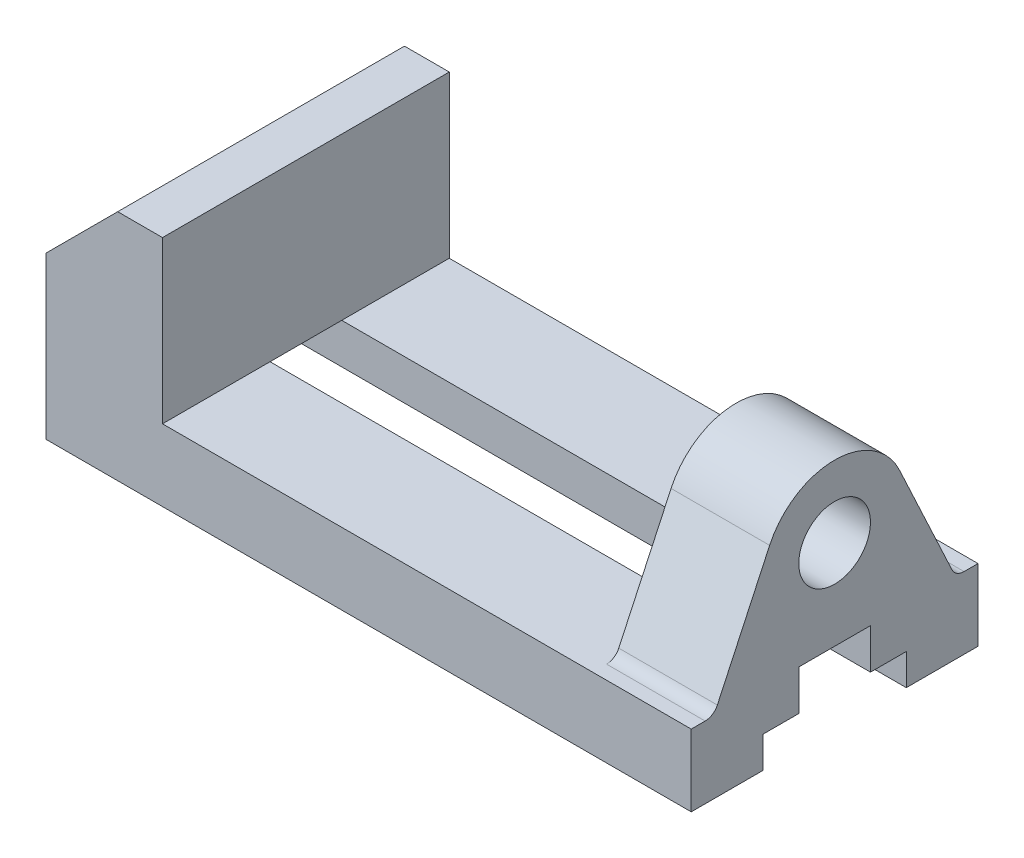
ISO-10303-21;
HEADER;
FILE_DESCRIPTION(('STEP AP214'),'2;1');
FILE_NAME('part.step','',(''),(''),'','','');
FILE_SCHEMA(('AUTOMOTIVE_DESIGN { 1 0 10303 214 1 1 1 1 }'));
ENDSEC;
DATA;
#1=APPLICATION_CONTEXT('core data for automotive mechanical design processes');
#2=APPLICATION_PROTOCOL_DEFINITION('international standard','automotive_design',2000,#1);
#3=PRODUCT_CONTEXT('',#1,'mechanical');
#4=PRODUCT('Part','Part','',(#3));
#5=PRODUCT_RELATED_PRODUCT_CATEGORY('part','',(#4));
#6=PRODUCT_DEFINITION_FORMATION('','',#4);
#7=PRODUCT_DEFINITION_CONTEXT('part definition',#1,'design');
#8=PRODUCT_DEFINITION('design','',#6,#7);
#9=PRODUCT_DEFINITION_SHAPE('','',#8);
#10=(LENGTH_UNIT() NAMED_UNIT(*) SI_UNIT(.MILLI.,.METRE.));
#11=(NAMED_UNIT(*) PLANE_ANGLE_UNIT() SI_UNIT($,.RADIAN.));
#12=(NAMED_UNIT(*) SI_UNIT($,.STERADIAN.) SOLID_ANGLE_UNIT());
#13=UNCERTAINTY_MEASURE_WITH_UNIT(LENGTH_MEASURE(1.E-05),#10,'distance_accuracy_value','');
#14=(GEOMETRIC_REPRESENTATION_CONTEXT(3) GLOBAL_UNCERTAINTY_ASSIGNED_CONTEXT((#13)) GLOBAL_UNIT_ASSIGNED_CONTEXT((#10,
#11,#12)) REPRESENTATION_CONTEXT('',''));
#15=CARTESIAN_POINT('',(0.,0.,0.));
#16=DIRECTION('',(0.,0.,1.));
#17=DIRECTION('',(1.,0.,0.));
#18=AXIS2_PLACEMENT_3D('',#15,#16,#17);
#19=CARTESIAN_POINT('',(-72.,0.,32.));
#20=DIRECTION('',(0.,1.,0.));
#21=DIRECTION('',(0.,0.,1.));
#22=AXIS2_PLACEMENT_3D('',#19,#20,#21);
#23=PLANE('',#22);
#24=DIRECTION('',(1.,0.,0.));
#25=VECTOR('',#24,1.);
#26=CARTESIAN_POINT('',(-72.001,0.,7.99999999999999));
#27=LINE('',#26,#25);
#28=CARTESIAN_POINT('',(-72.,0.,8.00000000000001));
#29=VERTEX_POINT('',#28);
#30=CARTESIAN_POINT('',(-46.,0.,7.99999999999999));
#31=VERTEX_POINT('',#30);
#32=EDGE_CURVE('E289',#29,#31,#27,.T.);
#33=ORIENTED_EDGE('',*,*,#32,.F.);
#34=DIRECTION('',(0.,0.,-1.));
#35=VECTOR('',#34,1.);
#36=CARTESIAN_POINT('',(-72.,0.,32.));
#37=LINE('',#36,#35);
#38=CARTESIAN_POINT('',(-72.,0.,-8.00000000000002));
#39=VERTEX_POINT('',#38);
#40=EDGE_CURVE('E351',#29,#39,#37,.T.);
#41=ORIENTED_EDGE('',*,*,#40,.T.);
#42=DIRECTION('',(1.,0.,0.));
#43=VECTOR('',#42,1.);
#44=CARTESIAN_POINT('',(-72.001,0.,-8.00000000000002));
#45=LINE('',#44,#43);
#46=CARTESIAN_POINT('',(-46.,0.,-8.00000000000002));
#47=VERTEX_POINT('',#46);
#48=EDGE_CURVE('E374',#39,#47,#45,.T.);
#49=ORIENTED_EDGE('',*,*,#48,.T.);
#50=DIRECTION('',(0.,0.,-1.));
#51=VECTOR('',#50,1.);
#52=CARTESIAN_POINT('',(-46.,0.,32.));
#53=LINE('',#52,#51);
#54=EDGE_CURVE('E347',#31,#47,#53,.T.);
#55=ORIENTED_EDGE('',*,*,#54,.F.);
#56=EDGE_LOOP('',(#33,#41,#49,#55));
#57=FACE_BOUND('',#56,.T.);
#58=ADVANCED_FACE('F32',(#57),#23,.F.);
#59=CARTESIAN_POINT('',(-72.,-16.,-32.));
#60=DIRECTION('',(0.,0.,-1.));
#61=DIRECTION('',(-1.,0.,0.));
#62=AXIS2_PLACEMENT_3D('',#59,#60,#61);
#63=PLANE('',#62);
#64=DIRECTION('',(-1.,0.,0.));
#65=VECTOR('',#64,1.);
#66=CARTESIAN_POINT('',(-72.,0.,-32.));
#67=LINE('',#66,#65);
#68=CARTESIAN_POINT('',(72.,0.,-32.));
#69=VERTEX_POINT('',#68);
#70=CARTESIAN_POINT('',(-46.,0.,-32.));
#71=VERTEX_POINT('',#70);
#72=EDGE_CURVE('E385',#69,#71,#67,.T.);
#73=ORIENTED_EDGE('',*,*,#72,.F.);
#74=DIRECTION('',(0.,1.,0.));
#75=VECTOR('',#74,1.);
#76=CARTESIAN_POINT('',(72.,-16.,-32.));
#77=LINE('',#76,#75);
#78=CARTESIAN_POINT('',(72.,-16.,-32.));
#79=VERTEX_POINT('',#78);
#80=EDGE_CURVE('E391',#79,#69,#77,.T.);
#81=ORIENTED_EDGE('',*,*,#80,.F.);
#82=DIRECTION('',(-1.,0.,0.));
#83=VECTOR('',#82,1.);
#84=CARTESIAN_POINT('',(-72.,-16.,-32.));
#85=LINE('',#84,#83);
#86=CARTESIAN_POINT('',(-72.,-16.,-32.));
#87=VERTEX_POINT('',#86);
#88=EDGE_CURVE('E384',#79,#87,#85,.T.);
#89=ORIENTED_EDGE('',*,*,#88,.T.);
#90=DIRECTION('',(0.,1.,0.));
#91=VECTOR('',#90,1.);
#92=CARTESIAN_POINT('',(-72.,-16.,-32.));
#93=LINE('',#92,#91);
#94=CARTESIAN_POINT('',(-72.,20.,-32.));
#95=VERTEX_POINT('',#94);
#96=EDGE_CURVE('E394',#87,#95,#93,.T.);
#97=ORIENTED_EDGE('',*,*,#96,.T.);
#98=DIRECTION('',(-0.707106781186548,-0.707106781186548,0.));
#99=VECTOR('',#98,1.);
#100=CARTESIAN_POINT('',(-72.,20.,-32.));
#101=LINE('',#100,#99);
#102=CARTESIAN_POINT('',(-56.,36.,-32.));
#103=VERTEX_POINT('',#102);
#104=EDGE_CURVE('E327',#103,#95,#101,.T.);
#105=ORIENTED_EDGE('',*,*,#104,.F.);
#106=DIRECTION('',(-1.,0.,0.));
#107=VECTOR('',#106,1.);
#108=CARTESIAN_POINT('',(-56.,36.,-32.));
#109=LINE('',#108,#107);
#110=CARTESIAN_POINT('',(-46.,36.,-32.));
#111=VERTEX_POINT('',#110);
#112=EDGE_CURVE('E335',#111,#103,#109,.T.);
#113=ORIENTED_EDGE('',*,*,#112,.F.);
#114=DIRECTION('',(0.,1.,0.));
#115=VECTOR('',#114,1.);
#116=CARTESIAN_POINT('',(-46.,0.,-32.));
#117=LINE('',#116,#115);
#118=EDGE_CURVE('E308',#71,#111,#117,.T.);
#119=ORIENTED_EDGE('',*,*,#118,.F.);
#120=EDGE_LOOP('',(#73,#81,#89,#97,#105,#113,#119));
#121=FACE_BOUND('',#120,.T.);
#122=ADVANCED_FACE('F482',(#121),#63,.T.);
#123=CARTESIAN_POINT('',(0.,-16.,0.));
#124=DIRECTION('',(0.,1.,0.));
#125=DIRECTION('',(0.,0.,1.));
#126=AXIS2_PLACEMENT_3D('',#123,#124,#125);
#127=PLANE('',#126);
#128=CARTESIAN_POINT('',(-35.,-16.,-22.));
#129=DIRECTION('',(0.,-1.,0.));
#130=DIRECTION('',(0.,0.,-1.));
#131=AXIS2_PLACEMENT_3D('',#128,#129,#130);
#132=CIRCLE('',#131,2.525);
#133=CARTESIAN_POINT('',(-35.,-16.,-24.525));
#134=VERTEX_POINT('',#133);
#135=EDGE_CURVE('E213',#134,#134,#132,.T.);
#136=ORIENTED_EDGE('',*,*,#135,.F.);
#137=EDGE_LOOP('',(#136));
#138=FACE_BOUND('',#137,.T.);
#139=CARTESIAN_POINT('',(35.,-16.,-22.));
#140=DIRECTION('',(0.,-1.,0.));
#141=DIRECTION('',(0.,0.,-1.));
#142=AXIS2_PLACEMENT_3D('',#139,#140,#141);
#143=CIRCLE('',#142,2.525);
#144=CARTESIAN_POINT('',(35.,-16.,-24.525));
#145=VERTEX_POINT('',#144);
#146=EDGE_CURVE('E206',#145,#145,#143,.T.);
#147=ORIENTED_EDGE('',*,*,#146,.F.);
#148=EDGE_LOOP('',(#147));
#149=FACE_BOUND('',#148,.T.);
#150=DIRECTION('',(0.,0.,-1.));
#151=VECTOR('',#150,1.);
#152=CARTESIAN_POINT('',(72.,-16.,-32.));
#153=LINE('',#152,#151);
#154=CARTESIAN_POINT('',(72.,-16.,-16.));
#155=VERTEX_POINT('',#154);
#156=EDGE_CURVE('E382',#155,#79,#153,.T.);
#157=ORIENTED_EDGE('',*,*,#156,.F.);
#158=DIRECTION('',(1.,0.,0.));
#159=VECTOR('',#158,1.);
#160=CARTESIAN_POINT('',(-72.001,-16.,-16.));
#161=LINE('',#160,#159);
#162=CARTESIAN_POINT('',(-72.,-16.,-16.));
#163=VERTEX_POINT('',#162);
#164=EDGE_CURVE('E372',#163,#155,#161,.T.);
#165=ORIENTED_EDGE('',*,*,#164,.F.);
#166=DIRECTION('',(0.,0.,1.));
#167=VECTOR('',#166,1.);
#168=CARTESIAN_POINT('',(-72.,-16.,-32.));
#169=LINE('',#168,#167);
#170=EDGE_CURVE('E388',#87,#163,#169,.T.);
#171=ORIENTED_EDGE('',*,*,#170,.F.);
#172=ORIENTED_EDGE('',*,*,#88,.F.);
#173=EDGE_LOOP('',(#157,#165,#171,#172));
#174=FACE_BOUND('',#173,.T.);
#175=ADVANCED_FACE('F497',(#138,#149,#174),#127,.F.);
#176=CARTESIAN_POINT('',(0.,0.,0.));
#177=DIRECTION('',(0.,1.,0.));
#178=DIRECTION('',(0.,0.,1.));
#179=AXIS2_PLACEMENT_3D('',#176,#177,#178);
#180=PLANE('',#179);
#181=DIRECTION('',(0.,0.,-1.));
#182=VECTOR('',#181,1.);
#183=CARTESIAN_POINT('',(50.,0.,-26.9801998664999));
#184=LINE('',#183,#182);
#185=CARTESIAN_POINT('',(50.,0.,-8.));
#186=VERTEX_POINT('',#185);
#187=CARTESIAN_POINT('',(50.,0.,-28.8914106489223));
#188=VERTEX_POINT('',#187);
#189=EDGE_CURVE('E254',#186,#188,#184,.T.);
#190=ORIENTED_EDGE('',*,*,#189,.T.);
#191=DIRECTION('',(1.,0.,0.));
#192=VECTOR('',#191,1.);
#193=CARTESIAN_POINT('',(72.,0.,-28.8914106489223));
#194=LINE('',#193,#192);
#195=CARTESIAN_POINT('',(72.,0.,-28.8914106489223));
#196=VERTEX_POINT('',#195);
#197=EDGE_CURVE('E404',#188,#196,#194,.T.);
#198=ORIENTED_EDGE('',*,*,#197,.T.);
#199=DIRECTION('',(0.,0.,-1.));
#200=VECTOR('',#199,1.);
#201=CARTESIAN_POINT('',(72.,0.,-32.));
#202=LINE('',#201,#200);
#203=EDGE_CURVE('E381',#196,#69,#202,.T.);
#204=ORIENTED_EDGE('',*,*,#203,.T.);
#205=ORIENTED_EDGE('',*,*,#72,.T.);
#206=EDGE_CURVE('E352',#47,#71,#53,.T.);
#207=ORIENTED_EDGE('',*,*,#206,.F.);
#208=EDGE_CURVE('E377',#47,#186,#45,.T.);
#209=ORIENTED_EDGE('',*,*,#208,.T.);
#210=EDGE_LOOP('',(#190,#198,#204,#205,#207,#209));
#211=FACE_BOUND('',#210,.T.);
#212=ADVANCED_FACE('F471',(#211),#180,.T.);
#213=CARTESIAN_POINT('',(-72.,-16.,-32.));
#214=DIRECTION('',(-1.,0.,0.));
#215=DIRECTION('',(0.,0.,1.));
#216=AXIS2_PLACEMENT_3D('',#213,#214,#215);
#217=PLANE('',#216);
#218=DIRECTION('',(0.,1.,0.));
#219=VECTOR('',#218,1.);
#220=CARTESIAN_POINT('',(-72.,-9.,-16.));
#221=LINE('',#220,#219);
#222=CARTESIAN_POINT('',(-72.,-9.,-16.));
#223=VERTEX_POINT('',#222);
#224=EDGE_CURVE('E357',#163,#223,#221,.T.);
#225=ORIENTED_EDGE('',*,*,#224,.T.);
#226=DIRECTION('',(0.,0.,1.));
#227=VECTOR('',#226,1.);
#228=CARTESIAN_POINT('',(-72.,-9.,-8.00000000000002));
#229=LINE('',#228,#227);
#230=CARTESIAN_POINT('',(-72.,-9.,-8.00000000000002));
#231=VERTEX_POINT('',#230);
#232=EDGE_CURVE('E354',#223,#231,#229,.T.);
#233=ORIENTED_EDGE('',*,*,#232,.T.);
#234=DIRECTION('',(0.,1.,0.));
#235=VECTOR('',#234,1.);
#236=CARTESIAN_POINT('',(-72.,0.,-8.00000000000002));
#237=LINE('',#236,#235);
#238=EDGE_CURVE('E371',#231,#39,#237,.T.);
#239=ORIENTED_EDGE('',*,*,#238,.T.);
#240=ORIENTED_EDGE('',*,*,#40,.F.);
#241=DIRECTION('',(0.,-1.,0.));
#242=VECTOR('',#241,1.);
#243=CARTESIAN_POINT('',(-72.,0.,7.99999999999999));
#244=LINE('',#243,#242);
#245=CARTESIAN_POINT('',(-72.,-9.00000000000001,7.99999999999999));
#246=VERTEX_POINT('',#245);
#247=EDGE_CURVE('E315',#29,#246,#244,.T.);
#248=ORIENTED_EDGE('',*,*,#247,.T.);
#249=DIRECTION('',(0.,0.,1.));
#250=VECTOR('',#249,1.);
#251=CARTESIAN_POINT('',(-72.,-9.00000000000001,7.99999999999999));
#252=LINE('',#251,#250);
#253=CARTESIAN_POINT('',(-72.,-9.00000000000001,16.));
#254=VERTEX_POINT('',#253);
#255=EDGE_CURVE('E286',#246,#254,#252,.T.);
#256=ORIENTED_EDGE('',*,*,#255,.T.);
#257=DIRECTION('',(0.,-1.,0.));
#258=VECTOR('',#257,1.);
#259=CARTESIAN_POINT('',(-72.,-9.00000000000001,16.));
#260=LINE('',#259,#258);
#261=CARTESIAN_POINT('',(-72.,-16.,16.));
#262=VERTEX_POINT('',#261);
#263=EDGE_CURVE('E309',#254,#262,#260,.T.);
#264=ORIENTED_EDGE('',*,*,#263,.T.);
#265=DIRECTION('',(0.,0.,1.));
#266=VECTOR('',#265,1.);
#267=CARTESIAN_POINT('',(-72.,-16.,-32.));
#268=LINE('',#267,#266);
#269=CARTESIAN_POINT('',(-72.,-16.,32.));
#270=VERTEX_POINT('',#269);
#271=EDGE_CURVE('E312',#262,#270,#268,.T.);
#272=ORIENTED_EDGE('',*,*,#271,.T.);
#273=DIRECTION('',(0.,-1.,0.));
#274=VECTOR('',#273,1.);
#275=CARTESIAN_POINT('',(-72.,0.,32.));
#276=LINE('',#275,#274);
#277=CARTESIAN_POINT('',(-72.,20.,32.));
#278=VERTEX_POINT('',#277);
#279=EDGE_CURVE('E324',#278,#270,#276,.T.);
#280=ORIENTED_EDGE('',*,*,#279,.F.);
#281=DIRECTION('',(0.,0.,-1.));
#282=VECTOR('',#281,1.);
#283=CARTESIAN_POINT('',(-72.,20.,32.));
#284=LINE('',#283,#282);
#285=EDGE_CURVE('E333',#278,#95,#284,.T.);
#286=ORIENTED_EDGE('',*,*,#285,.T.);
#287=ORIENTED_EDGE('',*,*,#96,.F.);
#288=ORIENTED_EDGE('',*,*,#170,.T.);
#289=EDGE_LOOP('',(#225,#233,#239,#240,#248,#256,#264,#272,#280,#286,#287,#288));
#290=FACE_BOUND('',#289,.T.);
#291=ADVANCED_FACE('F444',(#290),#217,.T.);
#292=CARTESIAN_POINT('',(72.,-16.,-32.));
#293=DIRECTION('',(1.,0.,0.));
#294=DIRECTION('',(0.,0.,-1.));
#295=AXIS2_PLACEMENT_3D('',#292,#293,#294);
#296=PLANE('',#295);
#297=DIRECTION('',(0.,1.,0.));
#298=VECTOR('',#297,1.);
#299=CARTESIAN_POINT('',(72.,-9.,-16.));
#300=LINE('',#299,#298);
#301=CARTESIAN_POINT('',(72.,-9.,-16.));
#302=VERTEX_POINT('',#301);
#303=EDGE_CURVE('E365',#155,#302,#300,.T.);
#304=ORIENTED_EDGE('',*,*,#303,.F.);
#305=ORIENTED_EDGE('',*,*,#156,.T.);
#306=ORIENTED_EDGE('',*,*,#80,.T.);
#307=ORIENTED_EDGE('',*,*,#203,.F.);
#308=CARTESIAN_POINT('',(72.,3.,-28.8914106489223));
#309=DIRECTION('',(1.,0.,0.));
#310=DIRECTION('',(0.,0.,-1.));
#311=AXIS2_PLACEMENT_3D('',#308,#309,#310);
#312=CIRCLE('',#311,3.);
#313=CARTESIAN_POINT('',(72.,1.7321452147779,-26.1724872878124));
#314=VERTEX_POINT('',#313);
#315=EDGE_CURVE('E40',#196,#314,#312,.F.);
#316=ORIENTED_EDGE('',*,*,#315,.T.);
#317=DIRECTION('',(0.,0.90630778703665,0.4226182617407));
#318=VECTOR('',#317,1.);
#319=CARTESIAN_POINT('',(72.,0.,-26.9801998664999));
#320=LINE('',#319,#318);
#321=CARTESIAN_POINT('',(72.,26.7618921878512,-14.5009245925864));
#322=VERTEX_POINT('',#321);
#323=EDGE_CURVE('E251',#314,#322,#320,.T.);
#324=ORIENTED_EDGE('',*,*,#323,.T.);
#325=CARTESIAN_POINT('',(72.,20.,0.));
#326=DIRECTION('',(1.,0.,0.));
#327=DIRECTION('',(0.,0.,-1.));
#328=AXIS2_PLACEMENT_3D('',#325,#326,#327);
#329=CIRCLE('',#328,16.);
#330=CARTESIAN_POINT('',(72.,26.7618921878512,14.5009245925864));
#331=VERTEX_POINT('',#330);
#332=EDGE_CURVE('E244',#322,#331,#329,.T.);
#333=ORIENTED_EDGE('',*,*,#332,.T.);
#334=DIRECTION('',(0.,-0.90630778703665,0.4226182617407));
#335=VECTOR('',#334,1.);
#336=CARTESIAN_POINT('',(72.,0.,26.9801998664999));
#337=LINE('',#336,#335);
#338=CARTESIAN_POINT('',(72.,1.7321452147779,26.1724872878124));
#339=VERTEX_POINT('',#338);
#340=EDGE_CURVE('E264',#331,#339,#337,.T.);
#341=ORIENTED_EDGE('',*,*,#340,.T.);
#342=CARTESIAN_POINT('',(72.,3.,28.8914106489223));
#343=DIRECTION('',(1.,0.,0.));
#344=DIRECTION('',(0.,0.,-1.));
#345=AXIS2_PLACEMENT_3D('',#342,#343,#344);
#346=CIRCLE('',#345,3.);
#347=CARTESIAN_POINT('',(72.,0.,28.8914106489223));
#348=VERTEX_POINT('',#347);
#349=EDGE_CURVE('E408',#339,#348,#346,.F.);
#350=ORIENTED_EDGE('',*,*,#349,.T.);
#351=DIRECTION('',(0.,0.,-1.));
#352=VECTOR('',#351,1.);
#353=CARTESIAN_POINT('',(72.,0.,-32.));
#354=LINE('',#353,#352);
#355=CARTESIAN_POINT('',(72.,0.,32.));
#356=VERTEX_POINT('',#355);
#357=EDGE_CURVE('E285',#356,#348,#354,.T.);
#358=ORIENTED_EDGE('',*,*,#357,.F.);
#359=DIRECTION('',(0.,1.,0.));
#360=VECTOR('',#359,1.);
#361=CARTESIAN_POINT('',(72.,-16.,32.));
#362=LINE('',#361,#360);
#363=CARTESIAN_POINT('',(72.,-16.,32.));
#364=VERTEX_POINT('',#363);
#365=EDGE_CURVE('E278',#364,#356,#362,.T.);
#366=ORIENTED_EDGE('',*,*,#365,.F.);
#367=DIRECTION('',(0.,0.,-1.));
#368=VECTOR('',#367,1.);
#369=CARTESIAN_POINT('',(72.,-16.,-32.));
#370=LINE('',#369,#368);
#371=CARTESIAN_POINT('',(72.,-16.,16.));
#372=VERTEX_POINT('',#371);
#373=EDGE_CURVE('E277',#364,#372,#370,.T.);
#374=ORIENTED_EDGE('',*,*,#373,.T.);
#375=DIRECTION('',(0.,-1.,0.));
#376=VECTOR('',#375,1.);
#377=CARTESIAN_POINT('',(72.,-9.00000000000001,16.));
#378=LINE('',#377,#376);
#379=CARTESIAN_POINT('',(72.,-9.00000000000001,16.));
#380=VERTEX_POINT('',#379);
#381=EDGE_CURVE('E298',#380,#372,#378,.T.);
#382=ORIENTED_EDGE('',*,*,#381,.F.);
#383=DIRECTION('',(0.,0.,1.));
#384=VECTOR('',#383,1.);
#385=CARTESIAN_POINT('',(72.,-9.00000000000001,8.00000000000002));
#386=LINE('',#385,#384);
#387=CARTESIAN_POINT('',(72.,-9.00000000000001,8.00000000000002));
#388=VERTEX_POINT('',#387);
#389=EDGE_CURVE('E297',#388,#380,#386,.T.);
#390=ORIENTED_EDGE('',*,*,#389,.F.);
#391=DIRECTION('',(0.,-1.,0.));
#392=VECTOR('',#391,1.);
#393=CARTESIAN_POINT('',(72.,0.,8.00000000000002));
#394=LINE('',#393,#392);
#395=CARTESIAN_POINT('',(72.,0.,8.00000000000002));
#396=VERTEX_POINT('',#395);
#397=EDGE_CURVE('E292',#396,#388,#394,.T.);
#398=ORIENTED_EDGE('',*,*,#397,.F.);
#399=DIRECTION('',(0.,0.,-1.));
#400=VECTOR('',#399,1.);
#401=CARTESIAN_POINT('',(72.,0.,-26.9801998664999));
#402=LINE('',#401,#400);
#403=CARTESIAN_POINT('',(72.,0.,-7.99999999999999));
#404=VERTEX_POINT('',#403);
#405=EDGE_CURVE('E267',#396,#404,#402,.T.);
#406=ORIENTED_EDGE('',*,*,#405,.T.);
#407=DIRECTION('',(0.,1.,0.));
#408=VECTOR('',#407,1.);
#409=CARTESIAN_POINT('',(72.,0.,-7.99999999999999));
#410=LINE('',#409,#408);
#411=CARTESIAN_POINT('',(72.,-9.,-7.99999999999999));
#412=VERTEX_POINT('',#411);
#413=EDGE_CURVE('E363',#412,#404,#410,.T.);
#414=ORIENTED_EDGE('',*,*,#413,.F.);
#415=DIRECTION('',(0.,0.,1.));
#416=VECTOR('',#415,1.);
#417=CARTESIAN_POINT('',(72.,-9.,-7.99999999999999));
#418=LINE('',#417,#416);
#419=EDGE_CURVE('E360',#302,#412,#418,.T.);
#420=ORIENTED_EDGE('',*,*,#419,.F.);
#421=EDGE_LOOP('',(#304,#305,#306,#307,#316,#324,#333,#341,#350,#358,#366,#374,#382,#390,#398,
#406,#414,#420));
#422=FACE_BOUND('',#421,.T.);
#423=CARTESIAN_POINT('',(72.,20.,0.));
#424=DIRECTION('',(1.,0.,0.));
#425=DIRECTION('',(0.,0.,-1.));
#426=AXIS2_PLACEMENT_3D('',#423,#424,#425);
#427=CIRCLE('',#426,8.);
#428=CARTESIAN_POINT('',(72.,20.,-8.));
#429=VERTEX_POINT('',#428);
#430=EDGE_CURVE('E240',#429,#429,#427,.T.);
#431=ORIENTED_EDGE('',*,*,#430,.F.);
#432=EDGE_LOOP('',(#431));
#433=FACE_BOUND('',#432,.T.);
#434=ADVANCED_FACE('F426',(#422,#433),#296,.T.);
#435=CARTESIAN_POINT('',(-72.001,0.,-8.00000000000002));
#436=DIRECTION('',(0.,0.,-1.));
#437=DIRECTION('',(-1.,0.,0.));
#438=AXIS2_PLACEMENT_3D('',#435,#436,#437);
#439=PLANE('',#438);
#440=DIRECTION('',(1.,0.,0.));
#441=VECTOR('',#440,1.);
#442=CARTESIAN_POINT('',(-72.001,-9.,-8.00000000000002));
#443=LINE('',#442,#441);
#444=EDGE_CURVE('E368',#231,#412,#443,.T.);
#445=ORIENTED_EDGE('',*,*,#444,.T.);
#446=ORIENTED_EDGE('',*,*,#413,.T.);
#447=DIRECTION('',(-1.,0.,0.));
#448=VECTOR('',#447,1.);
#449=CARTESIAN_POINT('',(-72.001,0.,-8.00000000000002));
#450=LINE('',#449,#448);
#451=EDGE_CURVE('E274',#404,#186,#450,.T.);
#452=ORIENTED_EDGE('',*,*,#451,.T.);
#453=ORIENTED_EDGE('',*,*,#208,.F.);
#454=ORIENTED_EDGE('',*,*,#48,.F.);
#455=ORIENTED_EDGE('',*,*,#238,.F.);
#456=EDGE_LOOP('',(#445,#446,#452,#453,#454,#455));
#457=FACE_BOUND('',#456,.T.);
#458=ADVANCED_FACE('F466',(#457),#439,.F.);
#459=CARTESIAN_POINT('',(-72.001,-9.,-16.));
#460=DIRECTION('',(0.,0.,-1.));
#461=DIRECTION('',(-1.,0.,0.));
#462=AXIS2_PLACEMENT_3D('',#459,#460,#461);
#463=PLANE('',#462);
#464=ORIENTED_EDGE('',*,*,#164,.T.);
#465=ORIENTED_EDGE('',*,*,#303,.T.);
#466=DIRECTION('',(1.,0.,0.));
#467=VECTOR('',#466,1.);
#468=CARTESIAN_POINT('',(-72.001,-9.,-16.));
#469=LINE('',#468,#467);
#470=EDGE_CURVE('E369',#223,#302,#469,.T.);
#471=ORIENTED_EDGE('',*,*,#470,.F.);
#472=ORIENTED_EDGE('',*,*,#224,.F.);
#473=EDGE_LOOP('',(#464,#465,#471,#472));
#474=FACE_BOUND('',#473,.T.);
#475=ADVANCED_FACE('F494',(#474),#463,.F.);
#476=CARTESIAN_POINT('',(-72.001,-9.,-8.00000000000002));
#477=DIRECTION('',(0.,1.,0.));
#478=DIRECTION('',(0.,0.,1.));
#479=AXIS2_PLACEMENT_3D('',#476,#477,#478);
#480=PLANE('',#479);
#481=ORIENTED_EDGE('',*,*,#470,.T.);
#482=ORIENTED_EDGE('',*,*,#419,.T.);
#483=ORIENTED_EDGE('',*,*,#444,.F.);
#484=ORIENTED_EDGE('',*,*,#232,.F.);
#485=EDGE_LOOP('',(#481,#482,#483,#484));
#486=FACE_BOUND('',#485,.T.);
#487=ADVANCED_FACE('F492',(#486),#480,.F.);
#488=CARTESIAN_POINT('',(-46.,0.,32.));
#489=DIRECTION('',(-1.,0.,0.));
#490=DIRECTION('',(0.,0.,1.));
#491=AXIS2_PLACEMENT_3D('',#488,#489,#490);
#492=PLANE('',#491);
#493=ORIENTED_EDGE('',*,*,#118,.T.);
#494=DIRECTION('',(0.,0.,-1.));
#495=VECTOR('',#494,1.);
#496=CARTESIAN_POINT('',(-46.,36.,32.));
#497=LINE('',#496,#495);
#498=CARTESIAN_POINT('',(-46.,36.,32.));
#499=VERTEX_POINT('',#498);
#500=EDGE_CURVE('E344',#499,#111,#497,.T.);
#501=ORIENTED_EDGE('',*,*,#500,.F.);
#502=DIRECTION('',(0.,1.,0.));
#503=VECTOR('',#502,1.);
#504=CARTESIAN_POINT('',(-46.,0.,32.));
#505=LINE('',#504,#503);
#506=CARTESIAN_POINT('',(-46.,0.,32.));
#507=VERTEX_POINT('',#506);
#508=EDGE_CURVE('E326',#507,#499,#505,.T.);
#509=ORIENTED_EDGE('',*,*,#508,.F.);
#510=EDGE_CURVE('E348',#507,#31,#53,.T.);
#511=ORIENTED_EDGE('',*,*,#510,.T.);
#512=ORIENTED_EDGE('',*,*,#54,.T.);
#513=ORIENTED_EDGE('',*,*,#206,.T.);
#514=EDGE_LOOP('',(#493,#501,#509,#511,#512,#513));
#515=FACE_BOUND('',#514,.T.);
#516=ADVANCED_FACE('F485',(#515),#492,.F.);
#517=CARTESIAN_POINT('',(-56.,36.,32.));
#518=DIRECTION('',(0.,-1.,0.));
#519=DIRECTION('',(0.,0.,-1.));
#520=AXIS2_PLACEMENT_3D('',#517,#518,#519);
#521=PLANE('',#520);
#522=ORIENTED_EDGE('',*,*,#112,.T.);
#523=DIRECTION('',(0.,0.,-1.));
#524=VECTOR('',#523,1.);
#525=CARTESIAN_POINT('',(-56.,36.,32.));
#526=LINE('',#525,#524);
#527=CARTESIAN_POINT('',(-56.,36.,32.));
#528=VERTEX_POINT('',#527);
#529=EDGE_CURVE('E341',#528,#103,#526,.T.);
#530=ORIENTED_EDGE('',*,*,#529,.F.);
#531=DIRECTION('',(-1.,0.,0.));
#532=VECTOR('',#531,1.);
#533=CARTESIAN_POINT('',(-56.,36.,32.));
#534=LINE('',#533,#532);
#535=EDGE_CURVE('E329',#499,#528,#534,.T.);
#536=ORIENTED_EDGE('',*,*,#535,.F.);
#537=ORIENTED_EDGE('',*,*,#500,.T.);
#538=EDGE_LOOP('',(#522,#530,#536,#537));
#539=FACE_BOUND('',#538,.T.);
#540=ADVANCED_FACE('F507',(#539),#521,.F.);
#541=CARTESIAN_POINT('',(-72.,20.,32.));
#542=DIRECTION('',(0.707106781186547,-0.707106781186547,0.));
#543=DIRECTION('',(0.707106781186548,0.707106781186548,0.));
#544=AXIS2_PLACEMENT_3D('',#541,#542,#543);
#545=PLANE('',#544);
#546=ORIENTED_EDGE('',*,*,#104,.T.);
#547=ORIENTED_EDGE('',*,*,#285,.F.);
#548=DIRECTION('',(-0.707106781186548,-0.707106781186548,0.));
#549=VECTOR('',#548,1.);
#550=CARTESIAN_POINT('',(-72.,20.,32.));
#551=LINE('',#550,#549);
#552=EDGE_CURVE('E331',#528,#278,#551,.T.);
#553=ORIENTED_EDGE('',*,*,#552,.F.);
#554=ORIENTED_EDGE('',*,*,#529,.T.);
#555=EDGE_LOOP('',(#546,#547,#553,#554));
#556=FACE_BOUND('',#555,.T.);
#557=ADVANCED_FACE('F502',(#556),#545,.F.);
#558=CARTESIAN_POINT('',(0.,0.,32.));
#559=DIRECTION('',(0.,0.,-1.));
#560=DIRECTION('',(-1.,0.,0.));
#561=AXIS2_PLACEMENT_3D('',#558,#559,#560);
#562=PLANE('',#561);
#563=ORIENTED_EDGE('',*,*,#279,.T.);
#564=DIRECTION('',(1.,0.,0.));
#565=VECTOR('',#564,1.);
#566=CARTESIAN_POINT('',(-72.,-16.,32.));
#567=LINE('',#566,#565);
#568=EDGE_CURVE('E282',#270,#364,#567,.T.);
#569=ORIENTED_EDGE('',*,*,#568,.T.);
#570=ORIENTED_EDGE('',*,*,#365,.T.);
#571=DIRECTION('',(1.,0.,0.));
#572=VECTOR('',#571,1.);
#573=CARTESIAN_POINT('',(-72.,0.,32.));
#574=LINE('',#573,#572);
#575=EDGE_CURVE('E283',#507,#356,#574,.T.);
#576=ORIENTED_EDGE('',*,*,#575,.F.);
#577=ORIENTED_EDGE('',*,*,#508,.T.);
#578=ORIENTED_EDGE('',*,*,#535,.T.);
#579=ORIENTED_EDGE('',*,*,#552,.T.);
#580=EDGE_LOOP('',(#563,#569,#570,#576,#577,#578,#579));
#581=FACE_BOUND('',#580,.T.);
#582=ADVANCED_FACE('F433',(#581),#562,.F.);
#583=CARTESIAN_POINT('',(0.,0.,0.));
#584=DIRECTION('',(0.,1.,0.));
#585=DIRECTION('',(0.,0.,1.));
#586=AXIS2_PLACEMENT_3D('',#583,#584,#585);
#587=PLANE('',#586);
#588=ORIENTED_EDGE('',*,*,#357,.T.);
#589=DIRECTION('',(1.,0.,0.));
#590=VECTOR('',#589,1.);
#591=CARTESIAN_POINT('',(50.,0.,28.8914106489223));
#592=LINE('',#591,#590);
#593=CARTESIAN_POINT('',(50.,0.,28.8914106489223));
#594=VERTEX_POINT('',#593);
#595=EDGE_CURVE('E401',#348,#594,#592,.F.);
#596=ORIENTED_EDGE('',*,*,#595,.T.);
#597=CARTESIAN_POINT('',(50.,0.,8.00000000000002));
#598=VERTEX_POINT('',#597);
#599=EDGE_CURVE('E255',#594,#598,#184,.T.);
#600=ORIENTED_EDGE('',*,*,#599,.T.);
#601=EDGE_CURVE('E293',#31,#598,#27,.T.);
#602=ORIENTED_EDGE('',*,*,#601,.F.);
#603=ORIENTED_EDGE('',*,*,#510,.F.);
#604=ORIENTED_EDGE('',*,*,#575,.T.);
#605=EDGE_LOOP('',(#588,#596,#600,#602,#603,#604));
#606=FACE_BOUND('',#605,.T.);
#607=ADVANCED_FACE('F429',(#606),#587,.T.);
#608=CARTESIAN_POINT('',(0.,-16.,0.));
#609=DIRECTION('',(0.,1.,0.));
#610=DIRECTION('',(0.,0.,1.));
#611=AXIS2_PLACEMENT_3D('',#608,#609,#610);
#612=PLANE('',#611);
#613=CARTESIAN_POINT('',(-35.,-16.,22.));
#614=DIRECTION('',(0.,-1.,0.));
#615=DIRECTION('',(0.,0.,-1.));
#616=AXIS2_PLACEMENT_3D('',#613,#614,#615);
#617=CIRCLE('',#616,2.525);
#618=CARTESIAN_POINT('',(-35.,-16.,19.475));
#619=VERTEX_POINT('',#618);
#620=EDGE_CURVE('E222',#619,#619,#617,.T.);
#621=ORIENTED_EDGE('',*,*,#620,.F.);
#622=EDGE_LOOP('',(#621));
#623=FACE_BOUND('',#622,.T.);
#624=CARTESIAN_POINT('',(35.,-16.,22.));
#625=DIRECTION('',(0.,-1.,0.));
#626=DIRECTION('',(0.,0.,-1.));
#627=AXIS2_PLACEMENT_3D('',#624,#625,#626);
#628=CIRCLE('',#627,2.525);
#629=CARTESIAN_POINT('',(35.,-16.,19.475));
#630=VERTEX_POINT('',#629);
#631=EDGE_CURVE('E231',#630,#630,#628,.T.);
#632=ORIENTED_EDGE('',*,*,#631,.F.);
#633=EDGE_LOOP('',(#632));
#634=FACE_BOUND('',#633,.T.);
#635=ORIENTED_EDGE('',*,*,#271,.F.);
#636=DIRECTION('',(1.,0.,0.));
#637=VECTOR('',#636,1.);
#638=CARTESIAN_POINT('',(-72.001,-16.,16.));
#639=LINE('',#638,#637);
#640=EDGE_CURVE('E281',#262,#372,#639,.T.);
#641=ORIENTED_EDGE('',*,*,#640,.T.);
#642=ORIENTED_EDGE('',*,*,#373,.F.);
#643=ORIENTED_EDGE('',*,*,#568,.F.);
#644=EDGE_LOOP('',(#635,#641,#642,#643));
#645=FACE_BOUND('',#644,.T.);
#646=ADVANCED_FACE('F439',(#623,#634,#645),#612,.F.);
#647=CARTESIAN_POINT('',(-72.001,-9.00000000000001,16.));
#648=DIRECTION('',(0.,0.,1.));
#649=DIRECTION('',(1.,0.,0.));
#650=AXIS2_PLACEMENT_3D('',#647,#648,#649);
#651=PLANE('',#650);
#652=DIRECTION('',(1.,0.,0.));
#653=VECTOR('',#652,1.);
#654=CARTESIAN_POINT('',(-72.001,-9.00000000000001,16.));
#655=LINE('',#654,#653);
#656=EDGE_CURVE('E299',#254,#380,#655,.T.);
#657=ORIENTED_EDGE('',*,*,#656,.T.);
#658=ORIENTED_EDGE('',*,*,#381,.T.);
#659=ORIENTED_EDGE('',*,*,#640,.F.);
#660=ORIENTED_EDGE('',*,*,#263,.F.);
#661=EDGE_LOOP('',(#657,#658,#659,#660));
#662=FACE_BOUND('',#661,.T.);
#663=ADVANCED_FACE('F441',(#662),#651,.F.);
#664=CARTESIAN_POINT('',(-72.001,-9.00000000000001,7.99999999999999));
#665=DIRECTION('',(0.,1.,0.));
#666=DIRECTION('',(0.,0.,1.));
#667=AXIS2_PLACEMENT_3D('',#664,#665,#666);
#668=PLANE('',#667);
#669=DIRECTION('',(1.,0.,0.));
#670=VECTOR('',#669,1.);
#671=CARTESIAN_POINT('',(-72.001,-9.00000000000001,7.99999999999999));
#672=LINE('',#671,#670);
#673=EDGE_CURVE('E295',#246,#388,#672,.T.);
#674=ORIENTED_EDGE('',*,*,#673,.T.);
#675=ORIENTED_EDGE('',*,*,#389,.T.);
#676=ORIENTED_EDGE('',*,*,#656,.F.);
#677=ORIENTED_EDGE('',*,*,#255,.F.);
#678=EDGE_LOOP('',(#674,#675,#676,#677));
#679=FACE_BOUND('',#678,.T.);
#680=ADVANCED_FACE('F449',(#679),#668,.F.);
#681=CARTESIAN_POINT('',(-72.001,0.,7.99999999999999));
#682=DIRECTION('',(0.,0.,1.));
#683=DIRECTION('',(1.,0.,0.));
#684=AXIS2_PLACEMENT_3D('',#681,#682,#683);
#685=PLANE('',#684);
#686=ORIENTED_EDGE('',*,*,#32,.T.);
#687=ORIENTED_EDGE('',*,*,#601,.T.);
#688=EDGE_CURVE('E294',#598,#396,#27,.T.);
#689=ORIENTED_EDGE('',*,*,#688,.T.);
#690=ORIENTED_EDGE('',*,*,#397,.T.);
#691=ORIENTED_EDGE('',*,*,#673,.F.);
#692=ORIENTED_EDGE('',*,*,#247,.F.);
#693=EDGE_LOOP('',(#686,#687,#689,#690,#691,#692));
#694=FACE_BOUND('',#693,.T.);
#695=ADVANCED_FACE('F451',(#694),#685,.F.);
#696=CARTESIAN_POINT('',(50.,0.,-26.9801998664999));
#697=DIRECTION('',(0.,-1.,0.));
#698=DIRECTION('',(0.,0.,-1.));
#699=AXIS2_PLACEMENT_3D('',#696,#697,#698);
#700=PLANE('',#699);
#701=ORIENTED_EDGE('',*,*,#451,.F.);
#702=ORIENTED_EDGE('',*,*,#405,.F.);
#703=ORIENTED_EDGE('',*,*,#688,.F.);
#704=EDGE_CURVE('E259',#598,#186,#184,.T.);
#705=ORIENTED_EDGE('',*,*,#704,.T.);
#706=EDGE_LOOP('',(#701,#702,#703,#705));
#707=FACE_BOUND('',#706,.T.);
#708=ADVANCED_FACE('F461',(#707),#700,.T.);
#709=CARTESIAN_POINT('',(50.,20.,0.));
#710=DIRECTION('',(1.,0.,0.));
#711=DIRECTION('',(0.,0.,-1.));
#712=AXIS2_PLACEMENT_3D('',#709,#710,#711);
#713=CYLINDRICAL_SURFACE('',#712,16.);
#714=ORIENTED_EDGE('',*,*,#332,.F.);
#715=DIRECTION('',(1.,0.,0.));
#716=VECTOR('',#715,1.);
#717=CARTESIAN_POINT('',(50.,26.7618921878512,-14.5009245925864));
#718=LINE('',#717,#716);
#719=CARTESIAN_POINT('',(50.,26.7618921878512,-14.5009245925864));
#720=VERTEX_POINT('',#719);
#721=EDGE_CURVE('E271',#720,#322,#718,.T.);
#722=ORIENTED_EDGE('',*,*,#721,.F.);
#723=CARTESIAN_POINT('',(50.,20.,0.));
#724=DIRECTION('',(1.,0.,0.));
#725=DIRECTION('',(0.,0.,-1.));
#726=AXIS2_PLACEMENT_3D('',#723,#724,#725);
#727=CIRCLE('',#726,16.);
#728=CARTESIAN_POINT('',(50.,26.7618921878512,14.5009245925864));
#729=VERTEX_POINT('',#728);
#730=EDGE_CURVE('E247',#720,#729,#727,.T.);
#731=ORIENTED_EDGE('',*,*,#730,.T.);
#732=DIRECTION('',(1.,0.,0.));
#733=VECTOR('',#732,1.);
#734=CARTESIAN_POINT('',(50.,26.7618921878512,14.5009245925864));
#735=LINE('',#734,#733);
#736=EDGE_CURVE('E261',#729,#331,#735,.T.);
#737=ORIENTED_EDGE('',*,*,#736,.T.);
#738=EDGE_LOOP('',(#714,#722,#731,#737));
#739=FACE_BOUND('',#738,.T.);
#740=ADVANCED_FACE('F559',(#739),#713,.T.);
#741=CARTESIAN_POINT('',(50.,0.,-26.9801998664999));
#742=DIRECTION('',(0.,0.4226182617407,-0.90630778703665));
#743=DIRECTION('',(0.,0.90630778703665,0.4226182617407));
#744=AXIS2_PLACEMENT_3D('',#741,#742,#743);
#745=PLANE('',#744);
#746=ORIENTED_EDGE('',*,*,#323,.F.);
#747=DIRECTION('',(1.,0.,0.));
#748=VECTOR('',#747,1.);
#749=CARTESIAN_POINT('',(50.,1.7321452147779,-26.1724872878124));
#750=LINE('',#749,#748);
#751=CARTESIAN_POINT('',(50.,1.7321452147779,-26.1724872878124));
#752=VERTEX_POINT('',#751);
#753=EDGE_CURVE('E47',#314,#752,#750,.F.);
#754=ORIENTED_EDGE('',*,*,#753,.T.);
#755=DIRECTION('',(0.,0.90630778703665,0.4226182617407));
#756=VECTOR('',#755,1.);
#757=CARTESIAN_POINT('',(50.,0.,-26.9801998664999));
#758=LINE('',#757,#756);
#759=EDGE_CURVE('E258',#752,#720,#758,.T.);
#760=ORIENTED_EDGE('',*,*,#759,.T.);
#761=ORIENTED_EDGE('',*,*,#721,.T.);
#762=EDGE_LOOP('',(#746,#754,#760,#761));
#763=FACE_BOUND('',#762,.T.);
#764=ADVANCED_FACE('F556',(#763),#745,.T.);
#765=CARTESIAN_POINT('',(50.,0.,26.9801998664999));
#766=DIRECTION('',(0.,0.4226182617407,0.90630778703665));
#767=DIRECTION('',(0.,-0.90630778703665,0.4226182617407));
#768=AXIS2_PLACEMENT_3D('',#765,#766,#767);
#769=PLANE('',#768);
#770=DIRECTION('',(0.,-0.90630778703665,0.4226182617407));
#771=VECTOR('',#770,1.);
#772=CARTESIAN_POINT('',(50.,0.,26.9801998664999));
#773=LINE('',#772,#771);
#774=CARTESIAN_POINT('',(50.,1.7321452147779,26.1724872878124));
#775=VERTEX_POINT('',#774);
#776=EDGE_CURVE('E250',#729,#775,#773,.T.);
#777=ORIENTED_EDGE('',*,*,#776,.T.);
#778=DIRECTION('',(1.,0.,0.));
#779=VECTOR('',#778,1.);
#780=CARTESIAN_POINT('',(72.,1.7321452147779,26.1724872878124));
#781=LINE('',#780,#779);
#782=EDGE_CURVE('E398',#775,#339,#781,.T.);
#783=ORIENTED_EDGE('',*,*,#782,.T.);
#784=ORIENTED_EDGE('',*,*,#340,.F.);
#785=ORIENTED_EDGE('',*,*,#736,.F.);
#786=EDGE_LOOP('',(#777,#783,#784,#785));
#787=FACE_BOUND('',#786,.T.);
#788=ADVANCED_FACE('F421',(#787),#769,.T.);
#789=CARTESIAN_POINT('',(50.,20.,0.));
#790=DIRECTION('',(1.,0.,0.));
#791=DIRECTION('',(0.,0.,-1.));
#792=AXIS2_PLACEMENT_3D('',#789,#790,#791);
#793=PLANE('',#792);
#794=CARTESIAN_POINT('',(50.,20.,0.));
#795=DIRECTION('',(1.,0.,0.));
#796=DIRECTION('',(0.,0.,-1.));
#797=AXIS2_PLACEMENT_3D('',#794,#795,#796);
#798=CIRCLE('',#797,8.);
#799=CARTESIAN_POINT('',(50.,20.,-8.));
#800=VERTEX_POINT('',#799);
#801=EDGE_CURVE('E241',#800,#800,#798,.T.);
#802=ORIENTED_EDGE('',*,*,#801,.T.);
#803=EDGE_LOOP('',(#802));
#804=FACE_BOUND('',#803,.T.);
#805=ORIENTED_EDGE('',*,*,#730,.F.);
#806=ORIENTED_EDGE('',*,*,#759,.F.);
#807=CARTESIAN_POINT('',(50.,3.,-28.8914106489223));
#808=DIRECTION('',(1.,0.,0.));
#809=DIRECTION('',(0.,0.,-1.));
#810=AXIS2_PLACEMENT_3D('',#807,#808,#809);
#811=CIRCLE('',#810,3.);
#812=EDGE_CURVE('E11',#752,#188,#811,.T.);
#813=ORIENTED_EDGE('',*,*,#812,.T.);
#814=ORIENTED_EDGE('',*,*,#189,.F.);
#815=ORIENTED_EDGE('',*,*,#704,.F.);
#816=ORIENTED_EDGE('',*,*,#599,.F.);
#817=CARTESIAN_POINT('',(50.,3.,28.8914106489223));
#818=DIRECTION('',(1.,0.,0.));
#819=DIRECTION('',(0.,0.,-1.));
#820=AXIS2_PLACEMENT_3D('',#817,#818,#819);
#821=CIRCLE('',#820,3.);
#822=EDGE_CURVE('E410',#594,#775,#821,.T.);
#823=ORIENTED_EDGE('',*,*,#822,.T.);
#824=ORIENTED_EDGE('',*,*,#776,.F.);
#825=EDGE_LOOP('',(#805,#806,#813,#814,#815,#816,#823,#824));
#826=FACE_BOUND('',#825,.T.);
#827=ADVANCED_FACE('F415',(#804,#826),#793,.F.);
#828=CARTESIAN_POINT('',(50.,20.,0.));
#829=DIRECTION('',(1.,0.,0.));
#830=DIRECTION('',(0.,0.,-1.));
#831=AXIS2_PLACEMENT_3D('',#828,#829,#830);
#832=CYLINDRICAL_SURFACE('',#831,8.);
#833=ORIENTED_EDGE('',*,*,#801,.F.);
#834=EDGE_LOOP('',(#833));
#835=FACE_BOUND('',#834,.T.);
#836=ORIENTED_EDGE('',*,*,#430,.T.);
#837=EDGE_LOOP('',(#836));
#838=FACE_BOUND('',#837,.T.);
#839=ADVANCED_FACE('F538',(#835,#838),#832,.F.);
#840=CARTESIAN_POINT('',(50.,3.,28.8914106489223));
#841=DIRECTION('',(-1.,0.,0.));
#842=DIRECTION('',(0.,0.,1.));
#843=AXIS2_PLACEMENT_3D('',#840,#841,#842);
#844=CYLINDRICAL_SURFACE('',#843,3.);
#845=ORIENTED_EDGE('',*,*,#822,.F.);
#846=ORIENTED_EDGE('',*,*,#595,.F.);
#847=ORIENTED_EDGE('',*,*,#349,.F.);
#848=ORIENTED_EDGE('',*,*,#782,.F.);
#849=EDGE_LOOP('',(#845,#846,#847,#848));
#850=FACE_BOUND('',#849,.T.);
#851=ADVANCED_FACE('F423',(#850),#844,.F.);
#852=CARTESIAN_POINT('',(0.,3.,-28.8914106489223));
#853=DIRECTION('',(-1.,0.,0.));
#854=DIRECTION('',(0.,0.,1.));
#855=AXIS2_PLACEMENT_3D('',#852,#853,#854);
#856=CYLINDRICAL_SURFACE('',#855,3.);
#857=ORIENTED_EDGE('',*,*,#812,.F.);
#858=ORIENTED_EDGE('',*,*,#753,.F.);
#859=ORIENTED_EDGE('',*,*,#315,.F.);
#860=ORIENTED_EDGE('',*,*,#197,.F.);
#861=EDGE_LOOP('',(#857,#858,#859,#860));
#862=FACE_BOUND('',#861,.T.);
#863=ADVANCED_FACE('F34',(#862),#856,.F.);
#864=CARTESIAN_POINT('',(35.,-7.5021515475689,22.));
#865=DIRECTION('',(0.,-1.,0.));
#866=DIRECTION('',(0.,0.,-1.));
#867=AXIS2_PLACEMENT_3D('',#864,#865,#866);
#868=CONICAL_SURFACE('',#867,2.5,1.02974425867665);
#869=CARTESIAN_POINT('',(35.,-6.,22.));
#870=VERTEX_POINT('',#869);
#871=VERTEX_LOOP('',#870);
#872=FACE_BOUND('',#871,.T.);
#873=CARTESIAN_POINT('',(35.,-7.5021515475689,22.));
#874=DIRECTION('',(0.,-1.,0.));
#875=DIRECTION('',(0.,0.,-1.));
#876=AXIS2_PLACEMENT_3D('',#873,#874,#875);
#877=CIRCLE('',#876,2.5);
#878=CARTESIAN_POINT('',(35.,-7.5021515475689,19.5));
#879=VERTEX_POINT('',#878);
#880=EDGE_CURVE('E237',#879,#879,#877,.T.);
#881=ORIENTED_EDGE('',*,*,#880,.T.);
#882=EDGE_LOOP('',(#881));
#883=FACE_BOUND('',#882,.T.);
#884=ADVANCED_FACE('F543',(#872,#883),#868,.F.);
#885=CARTESIAN_POINT('',(35.,-16.,22.));
#886=DIRECTION('',(0.,-1.,0.));
#887=DIRECTION('',(0.,0.,-1.));
#888=AXIS2_PLACEMENT_3D('',#885,#886,#887);
#889=CYLINDRICAL_SURFACE('',#888,2.5);
#890=ORIENTED_EDGE('',*,*,#880,.F.);
#891=EDGE_LOOP('',(#890));
#892=FACE_BOUND('',#891,.T.);
#893=CARTESIAN_POINT('',(35.,-15.975,22.));
#894=DIRECTION('',(0.,-1.,0.));
#895=DIRECTION('',(0.,0.,-1.));
#896=AXIS2_PLACEMENT_3D('',#893,#894,#895);
#897=CIRCLE('',#896,2.5);
#898=CARTESIAN_POINT('',(35.,-15.975,19.5));
#899=VERTEX_POINT('',#898);
#900=EDGE_CURVE('E234',#899,#899,#897,.T.);
#901=ORIENTED_EDGE('',*,*,#900,.T.);
#902=EDGE_LOOP('',(#901));
#903=FACE_BOUND('',#902,.T.);
#904=ADVANCED_FACE('F744',(#892,#903),#889,.F.);
#905=CARTESIAN_POINT('',(35.,-16.,22.));
#906=DIRECTION('',(0.,-1.,0.));
#907=DIRECTION('',(0.,0.,-1.));
#908=AXIS2_PLACEMENT_3D('',#905,#906,#907);
#909=CONICAL_SURFACE('',#908,2.525,0.785398163397518);
#910=ORIENTED_EDGE('',*,*,#900,.F.);
#911=EDGE_LOOP('',(#910));
#912=FACE_BOUND('',#911,.T.);
#913=ORIENTED_EDGE('',*,*,#631,.T.);
#914=EDGE_LOOP('',(#913));
#915=FACE_BOUND('',#914,.T.);
#916=ADVANCED_FACE('F750',(#912,#915),#909,.F.);
#917=CARTESIAN_POINT('',(-35.,-7.5021515475689,22.));
#918=DIRECTION('',(0.,-1.,0.));
#919=DIRECTION('',(0.,0.,-1.));
#920=AXIS2_PLACEMENT_3D('',#917,#918,#919);
#921=CONICAL_SURFACE('',#920,2.5,1.02974425867665);
#922=CARTESIAN_POINT('',(-35.,-6.,22.));
#923=VERTEX_POINT('',#922);
#924=VERTEX_LOOP('',#923);
#925=FACE_BOUND('',#924,.T.);
#926=CARTESIAN_POINT('',(-35.,-7.5021515475689,22.));
#927=DIRECTION('',(0.,-1.,0.));
#928=DIRECTION('',(0.,0.,-1.));
#929=AXIS2_PLACEMENT_3D('',#926,#927,#928);
#930=CIRCLE('',#929,2.5);
#931=CARTESIAN_POINT('',(-35.,-7.5021515475689,19.5));
#932=VERTEX_POINT('',#931);
#933=EDGE_CURVE('E228',#932,#932,#930,.T.);
#934=ORIENTED_EDGE('',*,*,#933,.T.);
#935=EDGE_LOOP('',(#934));
#936=FACE_BOUND('',#935,.T.);
#937=ADVANCED_FACE('F757',(#925,#936),#921,.F.);
#938=CARTESIAN_POINT('',(-35.,-16.,22.));
#939=DIRECTION('',(0.,-1.,0.));
#940=DIRECTION('',(0.,0.,-1.));
#941=AXIS2_PLACEMENT_3D('',#938,#939,#940);
#942=CYLINDRICAL_SURFACE('',#941,2.5);
#943=ORIENTED_EDGE('',*,*,#933,.F.);
#944=EDGE_LOOP('',(#943));
#945=FACE_BOUND('',#944,.T.);
#946=CARTESIAN_POINT('',(-35.,-15.975,22.));
#947=DIRECTION('',(0.,-1.,0.));
#948=DIRECTION('',(0.,0.,-1.));
#949=AXIS2_PLACEMENT_3D('',#946,#947,#948);
#950=CIRCLE('',#949,2.5);
#951=CARTESIAN_POINT('',(-35.,-15.975,19.5));
#952=VERTEX_POINT('',#951);
#953=EDGE_CURVE('E225',#952,#952,#950,.T.);
#954=ORIENTED_EDGE('',*,*,#953,.T.);
#955=EDGE_LOOP('',(#954));
#956=FACE_BOUND('',#955,.T.);
#957=ADVANCED_FACE('F765',(#945,#956),#942,.F.);
#958=CARTESIAN_POINT('',(-35.,-16.,22.));
#959=DIRECTION('',(0.,-1.,0.));
#960=DIRECTION('',(0.,0.,-1.));
#961=AXIS2_PLACEMENT_3D('',#958,#959,#960);
#962=CONICAL_SURFACE('',#961,2.525,0.785398163397518);
#963=ORIENTED_EDGE('',*,*,#953,.F.);
#964=EDGE_LOOP('',(#963));
#965=FACE_BOUND('',#964,.T.);
#966=ORIENTED_EDGE('',*,*,#620,.T.);
#967=EDGE_LOOP('',(#966));
#968=FACE_BOUND('',#967,.T.);
#969=ADVANCED_FACE('F773',(#965,#968),#962,.F.);
#970=CARTESIAN_POINT('',(35.,-7.5021515475689,-22.));
#971=DIRECTION('',(0.,-1.,0.));
#972=DIRECTION('',(0.,0.,-1.));
#973=AXIS2_PLACEMENT_3D('',#970,#971,#972);
#974=CONICAL_SURFACE('',#973,2.5,1.02974425867665);
#975=CARTESIAN_POINT('',(35.,-6.,-22.));
#976=VERTEX_POINT('',#975);
#977=VERTEX_LOOP('',#976);
#978=FACE_BOUND('',#977,.T.);
#979=CARTESIAN_POINT('',(35.,-7.5021515475689,-22.));
#980=DIRECTION('',(0.,-1.,0.));
#981=DIRECTION('',(0.,0.,-1.));
#982=AXIS2_PLACEMENT_3D('',#979,#980,#981);
#983=CIRCLE('',#982,2.5);
#984=CARTESIAN_POINT('',(35.,-7.5021515475689,-24.5));
#985=VERTEX_POINT('',#984);
#986=EDGE_CURVE('E219',#985,#985,#983,.T.);
#987=ORIENTED_EDGE('',*,*,#986,.T.);
#988=EDGE_LOOP('',(#987));
#989=FACE_BOUND('',#988,.T.);
#990=ADVANCED_FACE('F781',(#978,#989),#974,.F.);
#991=CARTESIAN_POINT('',(35.,-16.,-22.));
#992=DIRECTION('',(0.,-1.,0.));
#993=DIRECTION('',(0.,0.,-1.));
#994=AXIS2_PLACEMENT_3D('',#991,#992,#993);
#995=CYLINDRICAL_SURFACE('',#994,2.5);
#996=ORIENTED_EDGE('',*,*,#986,.F.);
#997=EDGE_LOOP('',(#996));
#998=FACE_BOUND('',#997,.T.);
#999=CARTESIAN_POINT('',(35.,-15.975,-22.));
#1000=DIRECTION('',(0.,-1.,0.));
#1001=DIRECTION('',(0.,0.,-1.));
#1002=AXIS2_PLACEMENT_3D('',#999,#1000,#1001);
#1003=CIRCLE('',#1002,2.5);
#1004=CARTESIAN_POINT('',(35.,-15.975,-24.5));
#1005=VERTEX_POINT('',#1004);
#1006=EDGE_CURVE('E210',#1005,#1005,#1003,.T.);
#1007=ORIENTED_EDGE('',*,*,#1006,.T.);
#1008=EDGE_LOOP('',(#1007));
#1009=FACE_BOUND('',#1008,.T.);
#1010=ADVANCED_FACE('F789',(#998,#1009),#995,.F.);
#1011=CARTESIAN_POINT('',(35.,-16.,-22.));
#1012=DIRECTION('',(0.,-1.,0.));
#1013=DIRECTION('',(0.,0.,-1.));
#1014=AXIS2_PLACEMENT_3D('',#1011,#1012,#1013);
#1015=CONICAL_SURFACE('',#1014,2.525,0.785398163397518);
#1016=ORIENTED_EDGE('',*,*,#1006,.F.);
#1017=EDGE_LOOP('',(#1016));
#1018=FACE_BOUND('',#1017,.T.);
#1019=ORIENTED_EDGE('',*,*,#146,.T.);
#1020=EDGE_LOOP('',(#1019));
#1021=FACE_BOUND('',#1020,.T.);
#1022=ADVANCED_FACE('F200',(#1018,#1021),#1015,.F.);
#1023=CARTESIAN_POINT('',(-35.,-7.5021515475689,-22.));
#1024=DIRECTION('',(0.,-1.,0.));
#1025=DIRECTION('',(0.,0.,-1.));
#1026=AXIS2_PLACEMENT_3D('',#1023,#1024,#1025);
#1027=CONICAL_SURFACE('',#1026,2.5,1.02974425867665);
#1028=CARTESIAN_POINT('',(-35.,-6.,-22.));
#1029=VERTEX_POINT('',#1028);
#1030=VERTEX_LOOP('',#1029);
#1031=FACE_BOUND('',#1030,.T.);
#1032=CARTESIAN_POINT('',(-35.,-7.5021515475689,-22.));
#1033=DIRECTION('',(0.,-1.,0.));
#1034=DIRECTION('',(0.,0.,-1.));
#1035=AXIS2_PLACEMENT_3D('',#1032,#1033,#1034);
#1036=CIRCLE('',#1035,2.5);
#1037=CARTESIAN_POINT('',(-35.,-7.5021515475689,-24.5));
#1038=VERTEX_POINT('',#1037);
#1039=EDGE_CURVE('E204',#1038,#1038,#1036,.T.);
#1040=ORIENTED_EDGE('',*,*,#1039,.T.);
#1041=EDGE_LOOP('',(#1040));
#1042=FACE_BOUND('',#1041,.T.);
#1043=ADVANCED_FACE('F196',(#1031,#1042),#1027,.F.);
#1044=CARTESIAN_POINT('',(-35.,-16.,-22.));
#1045=DIRECTION('',(0.,-1.,0.));
#1046=DIRECTION('',(0.,0.,-1.));
#1047=AXIS2_PLACEMENT_3D('',#1044,#1045,#1046);
#1048=CYLINDRICAL_SURFACE('',#1047,2.5);
#1049=ORIENTED_EDGE('',*,*,#1039,.F.);
#1050=EDGE_LOOP('',(#1049));
#1051=FACE_BOUND('',#1050,.T.);
#1052=CARTESIAN_POINT('',(-35.,-15.975,-22.));
#1053=DIRECTION('',(0.,-1.,0.));
#1054=DIRECTION('',(0.,0.,-1.));
#1055=AXIS2_PLACEMENT_3D('',#1052,#1053,#1054);
#1056=CIRCLE('',#1055,2.5);
#1057=CARTESIAN_POINT('',(-35.,-15.975,-24.5));
#1058=VERTEX_POINT('',#1057);
#1059=EDGE_CURVE('E207',#1058,#1058,#1056,.T.);
#1060=ORIENTED_EDGE('',*,*,#1059,.T.);
#1061=EDGE_LOOP('',(#1060));
#1062=FACE_BOUND('',#1061,.T.);
#1063=ADVANCED_FACE('F199',(#1051,#1062),#1048,.F.);
#1064=CARTESIAN_POINT('',(-35.,-16.,-22.));
#1065=DIRECTION('',(0.,-1.,0.));
#1066=DIRECTION('',(0.,0.,-1.));
#1067=AXIS2_PLACEMENT_3D('',#1064,#1065,#1066);
#1068=CONICAL_SURFACE('',#1067,2.525,0.785398163397518);
#1069=ORIENTED_EDGE('',*,*,#1059,.F.);
#1070=EDGE_LOOP('',(#1069));
#1071=FACE_BOUND('',#1070,.T.);
#1072=ORIENTED_EDGE('',*,*,#135,.T.);
#1073=EDGE_LOOP('',(#1072));
#1074=FACE_BOUND('',#1073,.T.);
#1075=ADVANCED_FACE('F815',(#1071,#1074),#1068,.F.);
#1076=CLOSED_SHELL('',(#58,#122,#175,#212,#291,#434,#458,#475,#487,#516,#540,#557,#582,#607,
#646,#663,#680,#695,#708,#740,#764,#788,#827,#839,#851,#863,#884,#904,#916,#937,#957,#969,#990,
#1010,#1022,#1043,#1063,#1075));
#1077=MANIFOLD_SOLID_BREP('B2',#1076);
#1078=ADVANCED_BREP_SHAPE_REPRESENTATION('',(#18,#1077),#14);
#1079=SHAPE_DEFINITION_REPRESENTATION(#9,#1078);
ENDSEC;
END-ISO-10303-21;
